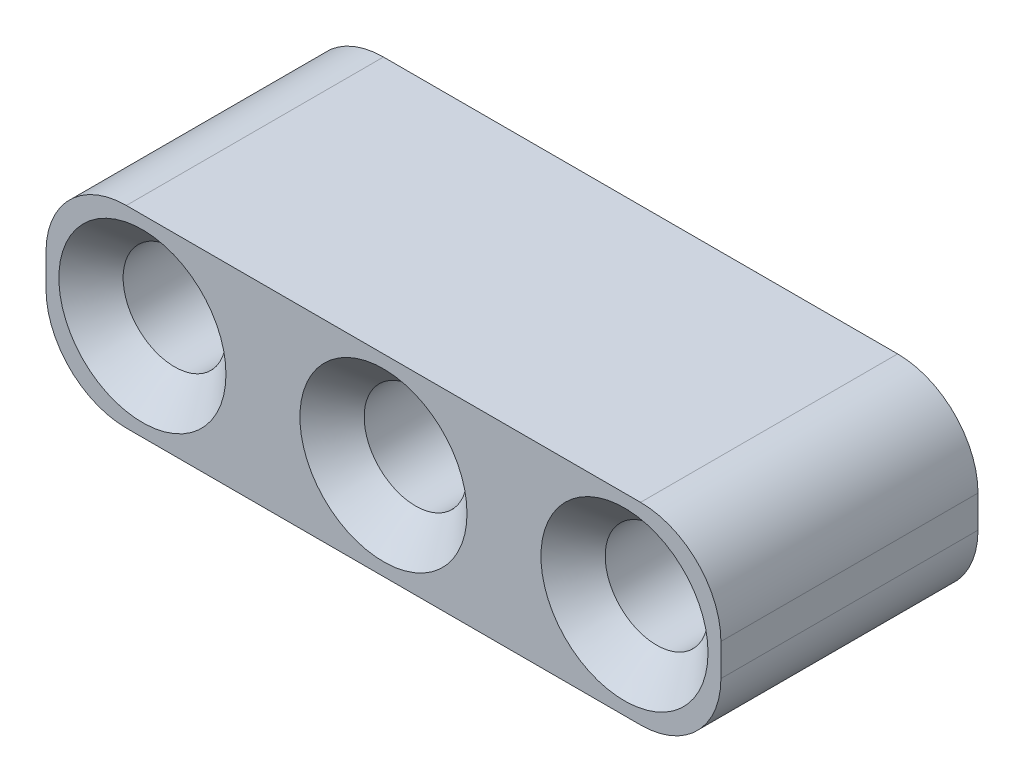
ISO-10303-21;
HEADER;
FILE_DESCRIPTION(('STEP AP214'),'2;1');
FILE_NAME('part.step','',(''),(''),'','','');
FILE_SCHEMA(('AUTOMOTIVE_DESIGN { 1 0 10303 214 1 1 1 1 }'));
ENDSEC;
DATA;
#1=APPLICATION_CONTEXT('core data for automotive mechanical design processes');
#2=APPLICATION_PROTOCOL_DEFINITION('international standard','automotive_design',2000,#1);
#3=PRODUCT_CONTEXT('',#1,'mechanical');
#4=PRODUCT('Part','Part','',(#3));
#5=PRODUCT_RELATED_PRODUCT_CATEGORY('part','',(#4));
#6=PRODUCT_DEFINITION_FORMATION('','',#4);
#7=PRODUCT_DEFINITION_CONTEXT('part definition',#1,'design');
#8=PRODUCT_DEFINITION('design','',#6,#7);
#9=PRODUCT_DEFINITION_SHAPE('','',#8);
#10=(LENGTH_UNIT() NAMED_UNIT(*) SI_UNIT(.MILLI.,.METRE.));
#11=(NAMED_UNIT(*) PLANE_ANGLE_UNIT() SI_UNIT($,.RADIAN.));
#12=(NAMED_UNIT(*) SI_UNIT($,.STERADIAN.) SOLID_ANGLE_UNIT());
#13=UNCERTAINTY_MEASURE_WITH_UNIT(LENGTH_MEASURE(1.E-05),#10,'distance_accuracy_value','');
#14=(GEOMETRIC_REPRESENTATION_CONTEXT(3) GLOBAL_UNCERTAINTY_ASSIGNED_CONTEXT((#13)) GLOBAL_UNIT_ASSIGNED_CONTEXT((#10,
#11,#12)) REPRESENTATION_CONTEXT('',''));
#15=CARTESIAN_POINT('',(0.,0.,0.));
#16=DIRECTION('',(0.,0.,1.));
#17=DIRECTION('',(1.,0.,0.));
#18=AXIS2_PLACEMENT_3D('',#15,#16,#17);
#19=CARTESIAN_POINT('',(15.5,-0.5,8.));
#20=DIRECTION('',(0.,0.,1.));
#21=DIRECTION('',(1.,0.,0.));
#22=AXIS2_PLACEMENT_3D('',#19,#20,#21);
#23=PLANE('',#22);
#24=CARTESIAN_POINT('',(15.,0.,8.));
#25=DIRECTION('',(0.,0.,1.));
#26=DIRECTION('',(1.,0.,0.));
#27=AXIS2_PLACEMENT_3D('',#24,#25,#26);
#28=CIRCLE('',#27,2.6);
#29=CARTESIAN_POINT('',(17.6,0.,8.));
#30=VERTEX_POINT('',#29);
#31=EDGE_CURVE('E180',#30,#30,#28,.F.);
#32=ORIENTED_EDGE('',*,*,#31,.T.);
#33=EDGE_LOOP('',(#32));
#34=FACE_BOUND('',#33,.T.);
#35=CARTESIAN_POINT('',(7.5,0.,8.));
#36=DIRECTION('',(0.,0.,1.));
#37=DIRECTION('',(1.,0.,0.));
#38=AXIS2_PLACEMENT_3D('',#35,#36,#37);
#39=CIRCLE('',#38,2.6);
#40=CARTESIAN_POINT('',(10.1,0.,8.));
#41=VERTEX_POINT('',#40);
#42=EDGE_CURVE('E177',#41,#41,#39,.F.);
#43=ORIENTED_EDGE('',*,*,#42,.T.);
#44=EDGE_LOOP('',(#43));
#45=FACE_BOUND('',#44,.T.);
#46=CARTESIAN_POINT('',(0.,0.,8.));
#47=DIRECTION('',(0.,0.,1.));
#48=DIRECTION('',(1.,0.,0.));
#49=AXIS2_PLACEMENT_3D('',#46,#47,#48);
#50=CIRCLE('',#49,2.6);
#51=CARTESIAN_POINT('',(2.6,0.,8.));
#52=VERTEX_POINT('',#51);
#53=EDGE_CURVE('E174',#52,#52,#50,.F.);
#54=ORIENTED_EDGE('',*,*,#53,.T.);
#55=EDGE_LOOP('',(#54));
#56=FACE_BOUND('',#55,.T.);
#57=CARTESIAN_POINT('',(15.5,-0.5,8.));
#58=DIRECTION('',(0.,0.,1.));
#59=DIRECTION('',(1.,0.,0.));
#60=AXIS2_PLACEMENT_3D('',#57,#58,#59);
#61=CIRCLE('',#60,2.5);
#62=CARTESIAN_POINT('',(15.5,-3.,8.));
#63=VERTEX_POINT('',#62);
#64=CARTESIAN_POINT('',(18.,-0.5,8.));
#65=VERTEX_POINT('',#64);
#66=EDGE_CURVE('E144',#63,#65,#61,.T.);
#67=ORIENTED_EDGE('',*,*,#66,.T.);
#68=DIRECTION('',(0.,1.,0.));
#69=VECTOR('',#68,1.);
#70=CARTESIAN_POINT('',(18.,0.5,8.));
#71=LINE('',#70,#69);
#72=CARTESIAN_POINT('',(18.,0.5,8.));
#73=VERTEX_POINT('',#72);
#74=EDGE_CURVE('E94',#65,#73,#71,.T.);
#75=ORIENTED_EDGE('',*,*,#74,.T.);
#76=CARTESIAN_POINT('',(15.5,0.5,8.));
#77=DIRECTION('',(0.,0.,1.));
#78=DIRECTION('',(-1.,0.,0.));
#79=AXIS2_PLACEMENT_3D('',#76,#77,#78);
#80=CIRCLE('',#79,2.5);
#81=CARTESIAN_POINT('',(15.5,3.,8.));
#82=VERTEX_POINT('',#81);
#83=EDGE_CURVE('E284',#73,#82,#80,.T.);
#84=ORIENTED_EDGE('',*,*,#83,.T.);
#85=DIRECTION('',(-1.,0.,0.));
#86=VECTOR('',#85,1.);
#87=CARTESIAN_POINT('',(-0.5,3.,8.));
#88=LINE('',#87,#86);
#89=CARTESIAN_POINT('',(-0.5,3.,8.));
#90=VERTEX_POINT('',#89);
#91=EDGE_CURVE('E288',#82,#90,#88,.T.);
#92=ORIENTED_EDGE('',*,*,#91,.T.);
#93=CARTESIAN_POINT('',(-0.5,0.5,8.));
#94=DIRECTION('',(0.,0.,1.));
#95=DIRECTION('',(1.,0.,0.));
#96=AXIS2_PLACEMENT_3D('',#93,#94,#95);
#97=CIRCLE('',#96,2.5);
#98=CARTESIAN_POINT('',(-3.,0.5,8.));
#99=VERTEX_POINT('',#98);
#100=EDGE_CURVE('E112',#90,#99,#97,.T.);
#101=ORIENTED_EDGE('',*,*,#100,.T.);
#102=DIRECTION('',(0.,-1.,0.));
#103=VECTOR('',#102,1.);
#104=CARTESIAN_POINT('',(-3.,0.5,8.));
#105=LINE('',#104,#103);
#106=CARTESIAN_POINT('',(-3.,-0.5,8.));
#107=VERTEX_POINT('',#106);
#108=EDGE_CURVE('E107',#99,#107,#105,.T.);
#109=ORIENTED_EDGE('',*,*,#108,.T.);
#110=CARTESIAN_POINT('',(-0.5,-0.5,8.));
#111=DIRECTION('',(0.,0.,1.));
#112=DIRECTION('',(1.,0.,0.));
#113=AXIS2_PLACEMENT_3D('',#110,#111,#112);
#114=CIRCLE('',#113,2.5);
#115=CARTESIAN_POINT('',(-0.5,-3.,8.));
#116=VERTEX_POINT('',#115);
#117=EDGE_CURVE('E110',#107,#116,#114,.T.);
#118=ORIENTED_EDGE('',*,*,#117,.T.);
#119=DIRECTION('',(1.,0.,0.));
#120=VECTOR('',#119,1.);
#121=CARTESIAN_POINT('',(-0.5,-3.,8.));
#122=LINE('',#121,#120);
#123=EDGE_CURVE('E50',#116,#63,#122,.T.);
#124=ORIENTED_EDGE('',*,*,#123,.T.);
#125=EDGE_LOOP('',(#67,#75,#84,#92,#101,#109,#118,#124));
#126=FACE_BOUND('',#125,.T.);
#127=ADVANCED_FACE('F33',(#34,#45,#56,#126),#23,.T.);
#128=CARTESIAN_POINT('',(15.5,-0.5,0.));
#129=DIRECTION('',(0.,0.,1.));
#130=DIRECTION('',(1.,0.,0.));
#131=AXIS2_PLACEMENT_3D('',#128,#129,#130);
#132=PLANE('',#131);
#133=CARTESIAN_POINT('',(15.,0.,0.));
#134=DIRECTION('',(0.,0.,1.));
#135=DIRECTION('',(1.,0.,0.));
#136=AXIS2_PLACEMENT_3D('',#133,#134,#135);
#137=CIRCLE('',#136,2.6);
#138=CARTESIAN_POINT('',(17.6,0.,0.));
#139=VERTEX_POINT('',#138);
#140=EDGE_CURVE('E165',#139,#139,#137,.T.);
#141=ORIENTED_EDGE('',*,*,#140,.T.);
#142=EDGE_LOOP('',(#141));
#143=FACE_BOUND('',#142,.T.);
#144=CARTESIAN_POINT('',(7.5,0.,0.));
#145=DIRECTION('',(0.,0.,1.));
#146=DIRECTION('',(1.,0.,0.));
#147=AXIS2_PLACEMENT_3D('',#144,#145,#146);
#148=CIRCLE('',#147,2.6);
#149=CARTESIAN_POINT('',(10.1,0.,0.));
#150=VERTEX_POINT('',#149);
#151=EDGE_CURVE('E162',#150,#150,#148,.T.);
#152=ORIENTED_EDGE('',*,*,#151,.T.);
#153=EDGE_LOOP('',(#152));
#154=FACE_BOUND('',#153,.T.);
#155=CARTESIAN_POINT('',(0.,0.,0.));
#156=DIRECTION('',(0.,0.,1.));
#157=DIRECTION('',(1.,0.,0.));
#158=AXIS2_PLACEMENT_3D('',#155,#156,#157);
#159=CIRCLE('',#158,2.6);
#160=CARTESIAN_POINT('',(2.6,0.,0.));
#161=VERTEX_POINT('',#160);
#162=EDGE_CURVE('E159',#161,#161,#159,.T.);
#163=ORIENTED_EDGE('',*,*,#162,.T.);
#164=EDGE_LOOP('',(#163));
#165=FACE_BOUND('',#164,.T.);
#166=CARTESIAN_POINT('',(15.5,-0.5,0.));
#167=DIRECTION('',(0.,0.,1.));
#168=DIRECTION('',(1.,0.,0.));
#169=AXIS2_PLACEMENT_3D('',#166,#167,#168);
#170=CIRCLE('',#169,2.5);
#171=CARTESIAN_POINT('',(15.5,-3.,0.));
#172=VERTEX_POINT('',#171);
#173=CARTESIAN_POINT('',(18.,-0.5,0.));
#174=VERTEX_POINT('',#173);
#175=EDGE_CURVE('E130',#172,#174,#170,.T.);
#176=ORIENTED_EDGE('',*,*,#175,.F.);
#177=DIRECTION('',(1.,0.,0.));
#178=VECTOR('',#177,1.);
#179=CARTESIAN_POINT('',(-0.5,-3.,0.));
#180=LINE('',#179,#178);
#181=CARTESIAN_POINT('',(-0.5,-3.,0.));
#182=VERTEX_POINT('',#181);
#183=EDGE_CURVE('E85',#182,#172,#180,.T.);
#184=ORIENTED_EDGE('',*,*,#183,.F.);
#185=CARTESIAN_POINT('',(-0.5,-0.5,0.));
#186=DIRECTION('',(0.,0.,1.));
#187=DIRECTION('',(1.,0.,0.));
#188=AXIS2_PLACEMENT_3D('',#185,#186,#187);
#189=CIRCLE('',#188,2.5);
#190=CARTESIAN_POINT('',(-3.,-0.5,0.));
#191=VERTEX_POINT('',#190);
#192=EDGE_CURVE('E79',#191,#182,#189,.T.);
#193=ORIENTED_EDGE('',*,*,#192,.F.);
#194=DIRECTION('',(0.,-1.,0.));
#195=VECTOR('',#194,1.);
#196=CARTESIAN_POINT('',(-3.,0.5,0.));
#197=LINE('',#196,#195);
#198=CARTESIAN_POINT('',(-3.,0.5,0.));
#199=VERTEX_POINT('',#198);
#200=EDGE_CURVE('E120',#199,#191,#197,.T.);
#201=ORIENTED_EDGE('',*,*,#200,.F.);
#202=CARTESIAN_POINT('',(-0.5,0.5,0.));
#203=DIRECTION('',(0.,0.,1.));
#204=DIRECTION('',(1.,0.,0.));
#205=AXIS2_PLACEMENT_3D('',#202,#203,#204);
#206=CIRCLE('',#205,2.5);
#207=CARTESIAN_POINT('',(-0.5,3.,0.));
#208=VERTEX_POINT('',#207);
#209=EDGE_CURVE('E139',#208,#199,#206,.T.);
#210=ORIENTED_EDGE('',*,*,#209,.F.);
#211=DIRECTION('',(-1.,0.,0.));
#212=VECTOR('',#211,1.);
#213=CARTESIAN_POINT('',(-0.5,3.,0.));
#214=LINE('',#213,#212);
#215=CARTESIAN_POINT('',(15.5,3.,0.));
#216=VERTEX_POINT('',#215);
#217=EDGE_CURVE('E137',#216,#208,#214,.T.);
#218=ORIENTED_EDGE('',*,*,#217,.F.);
#219=CARTESIAN_POINT('',(15.5,0.5,0.));
#220=DIRECTION('',(0.,0.,1.));
#221=DIRECTION('',(-1.,0.,0.));
#222=AXIS2_PLACEMENT_3D('',#219,#220,#221);
#223=CIRCLE('',#222,2.5);
#224=CARTESIAN_POINT('',(18.,0.5,0.));
#225=VERTEX_POINT('',#224);
#226=EDGE_CURVE('E135',#225,#216,#223,.T.);
#227=ORIENTED_EDGE('',*,*,#226,.F.);
#228=DIRECTION('',(0.,1.,0.));
#229=VECTOR('',#228,1.);
#230=CARTESIAN_POINT('',(18.,0.5,0.));
#231=LINE('',#230,#229);
#232=EDGE_CURVE('E133',#174,#225,#231,.T.);
#233=ORIENTED_EDGE('',*,*,#232,.F.);
#234=EDGE_LOOP('',(#176,#184,#193,#201,#210,#218,#227,#233));
#235=FACE_BOUND('',#234,.T.);
#236=ADVANCED_FACE('F203',(#143,#154,#165,#235),#132,.F.);
#237=CARTESIAN_POINT('',(15.5,-0.5,8.));
#238=DIRECTION('',(0.,0.,-1.));
#239=DIRECTION('',(-1.,0.,0.));
#240=AXIS2_PLACEMENT_3D('',#237,#238,#239);
#241=CYLINDRICAL_SURFACE('',#240,2.5);
#242=ORIENTED_EDGE('',*,*,#175,.T.);
#243=DIRECTION('',(0.,0.,-1.));
#244=VECTOR('',#243,1.);
#245=CARTESIAN_POINT('',(18.,-0.5,8.));
#246=LINE('',#245,#244);
#247=EDGE_CURVE('E157',#65,#174,#246,.T.);
#248=ORIENTED_EDGE('',*,*,#247,.F.);
#249=ORIENTED_EDGE('',*,*,#66,.F.);
#250=DIRECTION('',(0.,0.,-1.));
#251=VECTOR('',#250,1.);
#252=CARTESIAN_POINT('',(15.5,-3.,8.));
#253=LINE('',#252,#251);
#254=EDGE_CURVE('E126',#63,#172,#253,.T.);
#255=ORIENTED_EDGE('',*,*,#254,.T.);
#256=EDGE_LOOP('',(#242,#248,#249,#255));
#257=FACE_BOUND('',#256,.T.);
#258=ADVANCED_FACE('F209',(#257),#241,.T.);
#259=CARTESIAN_POINT('',(18.,0.5,8.));
#260=DIRECTION('',(-1.,0.,0.));
#261=DIRECTION('',(0.,0.,1.));
#262=AXIS2_PLACEMENT_3D('',#259,#260,#261);
#263=PLANE('',#262);
#264=ORIENTED_EDGE('',*,*,#232,.T.);
#265=DIRECTION('',(0.,0.,-1.));
#266=VECTOR('',#265,1.);
#267=CARTESIAN_POINT('',(18.,0.5,8.));
#268=LINE('',#267,#266);
#269=EDGE_CURVE('E154',#73,#225,#268,.T.);
#270=ORIENTED_EDGE('',*,*,#269,.F.);
#271=ORIENTED_EDGE('',*,*,#74,.F.);
#272=ORIENTED_EDGE('',*,*,#247,.T.);
#273=EDGE_LOOP('',(#264,#270,#271,#272));
#274=FACE_BOUND('',#273,.T.);
#275=ADVANCED_FACE('F234',(#274),#263,.F.);
#276=CARTESIAN_POINT('',(15.5,0.5,8.));
#277=DIRECTION('',(0.,0.,-1.));
#278=DIRECTION('',(-1.,0.,0.));
#279=AXIS2_PLACEMENT_3D('',#276,#277,#278);
#280=CYLINDRICAL_SURFACE('',#279,2.5);
#281=ORIENTED_EDGE('',*,*,#226,.T.);
#282=DIRECTION('',(0.,0.,-1.));
#283=VECTOR('',#282,1.);
#284=CARTESIAN_POINT('',(15.5,3.,8.));
#285=LINE('',#284,#283);
#286=EDGE_CURVE('E151',#82,#216,#285,.T.);
#287=ORIENTED_EDGE('',*,*,#286,.F.);
#288=ORIENTED_EDGE('',*,*,#83,.F.);
#289=ORIENTED_EDGE('',*,*,#269,.T.);
#290=EDGE_LOOP('',(#281,#287,#288,#289));
#291=FACE_BOUND('',#290,.T.);
#292=ADVANCED_FACE('F230',(#291),#280,.T.);
#293=CARTESIAN_POINT('',(-0.5,3.,8.));
#294=DIRECTION('',(0.,-1.,0.));
#295=DIRECTION('',(1.,0.,0.));
#296=AXIS2_PLACEMENT_3D('',#293,#294,#295);
#297=PLANE('',#296);
#298=ORIENTED_EDGE('',*,*,#217,.T.);
#299=DIRECTION('',(0.,0.,-1.));
#300=VECTOR('',#299,1.);
#301=CARTESIAN_POINT('',(-0.5,3.,8.));
#302=LINE('',#301,#300);
#303=EDGE_CURVE('E148',#90,#208,#302,.T.);
#304=ORIENTED_EDGE('',*,*,#303,.F.);
#305=ORIENTED_EDGE('',*,*,#91,.F.);
#306=ORIENTED_EDGE('',*,*,#286,.T.);
#307=EDGE_LOOP('',(#298,#304,#305,#306));
#308=FACE_BOUND('',#307,.T.);
#309=ADVANCED_FACE('F226',(#308),#297,.F.);
#310=CARTESIAN_POINT('',(-0.5,0.5,8.));
#311=DIRECTION('',(0.,0.,-1.));
#312=DIRECTION('',(-1.,0.,0.));
#313=AXIS2_PLACEMENT_3D('',#310,#311,#312);
#314=CYLINDRICAL_SURFACE('',#313,2.5);
#315=ORIENTED_EDGE('',*,*,#209,.T.);
#316=DIRECTION('',(0.,0.,-1.));
#317=VECTOR('',#316,1.);
#318=CARTESIAN_POINT('',(-3.,0.5,8.));
#319=LINE('',#318,#317);
#320=EDGE_CURVE('E121',#99,#199,#319,.T.);
#321=ORIENTED_EDGE('',*,*,#320,.F.);
#322=ORIENTED_EDGE('',*,*,#100,.F.);
#323=ORIENTED_EDGE('',*,*,#303,.T.);
#324=EDGE_LOOP('',(#315,#321,#322,#323));
#325=FACE_BOUND('',#324,.T.);
#326=ADVANCED_FACE('F223',(#325),#314,.T.);
#327=CARTESIAN_POINT('',(-3.,0.5,8.));
#328=DIRECTION('',(1.,0.,0.));
#329=DIRECTION('',(0.,0.,-1.));
#330=AXIS2_PLACEMENT_3D('',#327,#328,#329);
#331=PLANE('',#330);
#332=ORIENTED_EDGE('',*,*,#200,.T.);
#333=DIRECTION('',(0.,0.,-1.));
#334=VECTOR('',#333,1.);
#335=CARTESIAN_POINT('',(-3.,-0.5,8.));
#336=LINE('',#335,#334);
#337=EDGE_CURVE('E117',#107,#191,#336,.T.);
#338=ORIENTED_EDGE('',*,*,#337,.F.);
#339=ORIENTED_EDGE('',*,*,#108,.F.);
#340=ORIENTED_EDGE('',*,*,#320,.T.);
#341=EDGE_LOOP('',(#332,#338,#339,#340));
#342=FACE_BOUND('',#341,.T.);
#343=ADVANCED_FACE('F118',(#342),#331,.F.);
#344=CARTESIAN_POINT('',(-0.5,-0.5,8.));
#345=DIRECTION('',(0.,0.,-1.));
#346=DIRECTION('',(-1.,0.,0.));
#347=AXIS2_PLACEMENT_3D('',#344,#345,#346);
#348=CYLINDRICAL_SURFACE('',#347,2.5);
#349=ORIENTED_EDGE('',*,*,#192,.T.);
#350=DIRECTION('',(0.,0.,-1.));
#351=VECTOR('',#350,1.);
#352=CARTESIAN_POINT('',(-0.5,-3.,8.));
#353=LINE('',#352,#351);
#354=EDGE_CURVE('E122',#116,#182,#353,.T.);
#355=ORIENTED_EDGE('',*,*,#354,.F.);
#356=ORIENTED_EDGE('',*,*,#117,.F.);
#357=ORIENTED_EDGE('',*,*,#337,.T.);
#358=EDGE_LOOP('',(#349,#355,#356,#357));
#359=FACE_BOUND('',#358,.T.);
#360=ADVANCED_FACE('F124',(#359),#348,.T.);
#361=CARTESIAN_POINT('',(-0.5,-3.,8.));
#362=DIRECTION('',(0.,1.,0.));
#363=DIRECTION('',(-1.,0.,0.));
#364=AXIS2_PLACEMENT_3D('',#361,#362,#363);
#365=PLANE('',#364);
#366=ORIENTED_EDGE('',*,*,#183,.T.);
#367=ORIENTED_EDGE('',*,*,#254,.F.);
#368=ORIENTED_EDGE('',*,*,#123,.F.);
#369=ORIENTED_EDGE('',*,*,#354,.T.);
#370=EDGE_LOOP('',(#366,#367,#368,#369));
#371=FACE_BOUND('',#370,.T.);
#372=ADVANCED_FACE('F216',(#371),#365,.F.);
#373=CARTESIAN_POINT('',(0.,0.,8.));
#374=DIRECTION('',(0.,0.,-1.));
#375=DIRECTION('',(-1.,0.,0.));
#376=AXIS2_PLACEMENT_3D('',#373,#374,#375);
#377=CYLINDRICAL_SURFACE('',#376,1.6);
#378=CARTESIAN_POINT('',(0.,0.,1.00000000000001));
#379=DIRECTION('',(0.,0.,1.));
#380=DIRECTION('',(1.,0.,0.));
#381=AXIS2_PLACEMENT_3D('',#378,#379,#380);
#382=CIRCLE('',#381,1.6);
#383=CARTESIAN_POINT('',(1.6,0.,1.00000000000001));
#384=VERTEX_POINT('',#383);
#385=EDGE_CURVE('E11',#384,#384,#382,.F.);
#386=ORIENTED_EDGE('',*,*,#385,.T.);
#387=EDGE_LOOP('',(#386));
#388=FACE_BOUND('',#387,.T.);
#389=CARTESIAN_POINT('',(0.,0.,7.));
#390=DIRECTION('',(0.,0.,1.));
#391=DIRECTION('',(1.,0.,0.));
#392=AXIS2_PLACEMENT_3D('',#389,#390,#391);
#393=CIRCLE('',#392,1.6);
#394=CARTESIAN_POINT('',(1.6,0.,7.));
#395=VERTEX_POINT('',#394);
#396=EDGE_CURVE('E42',#395,#395,#393,.T.);
#397=ORIENTED_EDGE('',*,*,#396,.T.);
#398=EDGE_LOOP('',(#397));
#399=FACE_BOUND('',#398,.T.);
#400=ADVANCED_FACE('F191',(#388,#399),#377,.F.);
#401=CARTESIAN_POINT('',(7.5,0.,8.));
#402=DIRECTION('',(0.,0.,-1.));
#403=DIRECTION('',(-1.,0.,0.));
#404=AXIS2_PLACEMENT_3D('',#401,#402,#403);
#405=CYLINDRICAL_SURFACE('',#404,1.6);
#406=CARTESIAN_POINT('',(7.5,0.,1.));
#407=DIRECTION('',(0.,0.,1.));
#408=DIRECTION('',(1.,0.,0.));
#409=AXIS2_PLACEMENT_3D('',#406,#407,#408);
#410=CIRCLE('',#409,1.6);
#411=CARTESIAN_POINT('',(9.1,0.,1.));
#412=VERTEX_POINT('',#411);
#413=EDGE_CURVE('E186',#412,#412,#410,.F.);
#414=ORIENTED_EDGE('',*,*,#413,.T.);
#415=EDGE_LOOP('',(#414));
#416=FACE_BOUND('',#415,.T.);
#417=CARTESIAN_POINT('',(7.5,0.,7.));
#418=DIRECTION('',(0.,0.,1.));
#419=DIRECTION('',(1.,0.,0.));
#420=AXIS2_PLACEMENT_3D('',#417,#418,#419);
#421=CIRCLE('',#420,1.6);
#422=CARTESIAN_POINT('',(9.1,0.,7.));
#423=VERTEX_POINT('',#422);
#424=EDGE_CURVE('E183',#423,#423,#421,.T.);
#425=ORIENTED_EDGE('',*,*,#424,.T.);
#426=EDGE_LOOP('',(#425));
#427=FACE_BOUND('',#426,.T.);
#428=ADVANCED_FACE('F262',(#416,#427),#405,.F.);
#429=CARTESIAN_POINT('',(15.,0.,8.));
#430=DIRECTION('',(0.,0.,-1.));
#431=DIRECTION('',(-1.,0.,0.));
#432=AXIS2_PLACEMENT_3D('',#429,#430,#431);
#433=CYLINDRICAL_SURFACE('',#432,1.6);
#434=CARTESIAN_POINT('',(15.,0.,1.));
#435=DIRECTION('',(0.,0.,1.));
#436=DIRECTION('',(1.,0.,0.));
#437=AXIS2_PLACEMENT_3D('',#434,#435,#436);
#438=CIRCLE('',#437,1.6);
#439=CARTESIAN_POINT('',(16.6,0.,1.));
#440=VERTEX_POINT('',#439);
#441=EDGE_CURVE('E171',#440,#440,#438,.F.);
#442=ORIENTED_EDGE('',*,*,#441,.T.);
#443=EDGE_LOOP('',(#442));
#444=FACE_BOUND('',#443,.T.);
#445=CARTESIAN_POINT('',(15.,0.,7.));
#446=DIRECTION('',(0.,0.,1.));
#447=DIRECTION('',(1.,0.,0.));
#448=AXIS2_PLACEMENT_3D('',#445,#446,#447);
#449=CIRCLE('',#448,1.6);
#450=CARTESIAN_POINT('',(16.6,0.,7.));
#451=VERTEX_POINT('',#450);
#452=EDGE_CURVE('E168',#451,#451,#449,.T.);
#453=ORIENTED_EDGE('',*,*,#452,.T.);
#454=EDGE_LOOP('',(#453));
#455=FACE_BOUND('',#454,.T.);
#456=ADVANCED_FACE('F245',(#444,#455),#433,.F.);
#457=CARTESIAN_POINT('',(15.,0.,0.));
#458=DIRECTION('',(0.,0.,-1.));
#459=DIRECTION('',(-1.,0.,0.));
#460=AXIS2_PLACEMENT_3D('',#457,#458,#459);
#461=CONICAL_SURFACE('',#460,2.6,0.785398163397447);
#462=ORIENTED_EDGE('',*,*,#441,.F.);
#463=EDGE_LOOP('',(#462));
#464=FACE_BOUND('',#463,.T.);
#465=ORIENTED_EDGE('',*,*,#140,.F.);
#466=EDGE_LOOP('',(#465));
#467=FACE_BOUND('',#466,.T.);
#468=ADVANCED_FACE('F241',(#464,#467),#461,.F.);
#469=CARTESIAN_POINT('',(15.,0.,7.));
#470=DIRECTION('',(0.,0.,1.));
#471=DIRECTION('',(1.,0.,0.));
#472=AXIS2_PLACEMENT_3D('',#469,#470,#471);
#473=CONICAL_SURFACE('',#472,1.6,0.78539816339745);
#474=ORIENTED_EDGE('',*,*,#31,.F.);
#475=EDGE_LOOP('',(#474));
#476=FACE_BOUND('',#475,.T.);
#477=ORIENTED_EDGE('',*,*,#452,.F.);
#478=EDGE_LOOP('',(#477));
#479=FACE_BOUND('',#478,.T.);
#480=ADVANCED_FACE('F244',(#476,#479),#473,.F.);
#481=CARTESIAN_POINT('',(7.5,0.,0.));
#482=DIRECTION('',(0.,0.,-1.));
#483=DIRECTION('',(-1.,0.,0.));
#484=AXIS2_PLACEMENT_3D('',#481,#482,#483);
#485=CONICAL_SURFACE('',#484,2.6,0.785398163397445);
#486=ORIENTED_EDGE('',*,*,#413,.F.);
#487=EDGE_LOOP('',(#486));
#488=FACE_BOUND('',#487,.T.);
#489=ORIENTED_EDGE('',*,*,#151,.F.);
#490=EDGE_LOOP('',(#489));
#491=FACE_BOUND('',#490,.T.);
#492=ADVANCED_FACE('F249',(#488,#491),#485,.F.);
#493=CARTESIAN_POINT('',(7.5,0.,7.));
#494=DIRECTION('',(0.,0.,1.));
#495=DIRECTION('',(1.,0.,0.));
#496=AXIS2_PLACEMENT_3D('',#493,#494,#495);
#497=CONICAL_SURFACE('',#496,1.6,0.785398163397451);
#498=ORIENTED_EDGE('',*,*,#42,.F.);
#499=EDGE_LOOP('',(#498));
#500=FACE_BOUND('',#499,.T.);
#501=ORIENTED_EDGE('',*,*,#424,.F.);
#502=EDGE_LOOP('',(#501));
#503=FACE_BOUND('',#502,.T.);
#504=ADVANCED_FACE('F199',(#500,#503),#497,.F.);
#505=CARTESIAN_POINT('',(0.,0.,0.));
#506=DIRECTION('',(0.,0.,-1.));
#507=DIRECTION('',(-1.,0.,0.));
#508=AXIS2_PLACEMENT_3D('',#505,#506,#507);
#509=CONICAL_SURFACE('',#508,2.6,0.785398163397445);
#510=ORIENTED_EDGE('',*,*,#385,.F.);
#511=EDGE_LOOP('',(#510));
#512=FACE_BOUND('',#511,.T.);
#513=ORIENTED_EDGE('',*,*,#162,.F.);
#514=EDGE_LOOP('',(#513));
#515=FACE_BOUND('',#514,.T.);
#516=ADVANCED_FACE('F194',(#512,#515),#509,.F.);
#517=CARTESIAN_POINT('',(0.,0.,7.));
#518=DIRECTION('',(0.,0.,1.));
#519=DIRECTION('',(1.,0.,0.));
#520=AXIS2_PLACEMENT_3D('',#517,#518,#519);
#521=CONICAL_SURFACE('',#520,1.6,0.785398163397451);
#522=ORIENTED_EDGE('',*,*,#53,.F.);
#523=EDGE_LOOP('',(#522));
#524=FACE_BOUND('',#523,.T.);
#525=ORIENTED_EDGE('',*,*,#396,.F.);
#526=EDGE_LOOP('',(#525));
#527=FACE_BOUND('',#526,.T.);
#528=ADVANCED_FACE('F35',(#524,#527),#521,.F.);
#529=CLOSED_SHELL('',(#127,#236,#258,#275,#292,#309,#326,#343,#360,#372,#400,#428,#456,#468,
#480,#492,#504,#516,#528));
#530=MANIFOLD_SOLID_BREP('B2',#529);
#531=ADVANCED_BREP_SHAPE_REPRESENTATION('',(#18,#530),#14);
#532=SHAPE_DEFINITION_REPRESENTATION(#9,#531);
ENDSEC;
END-ISO-10303-21;
